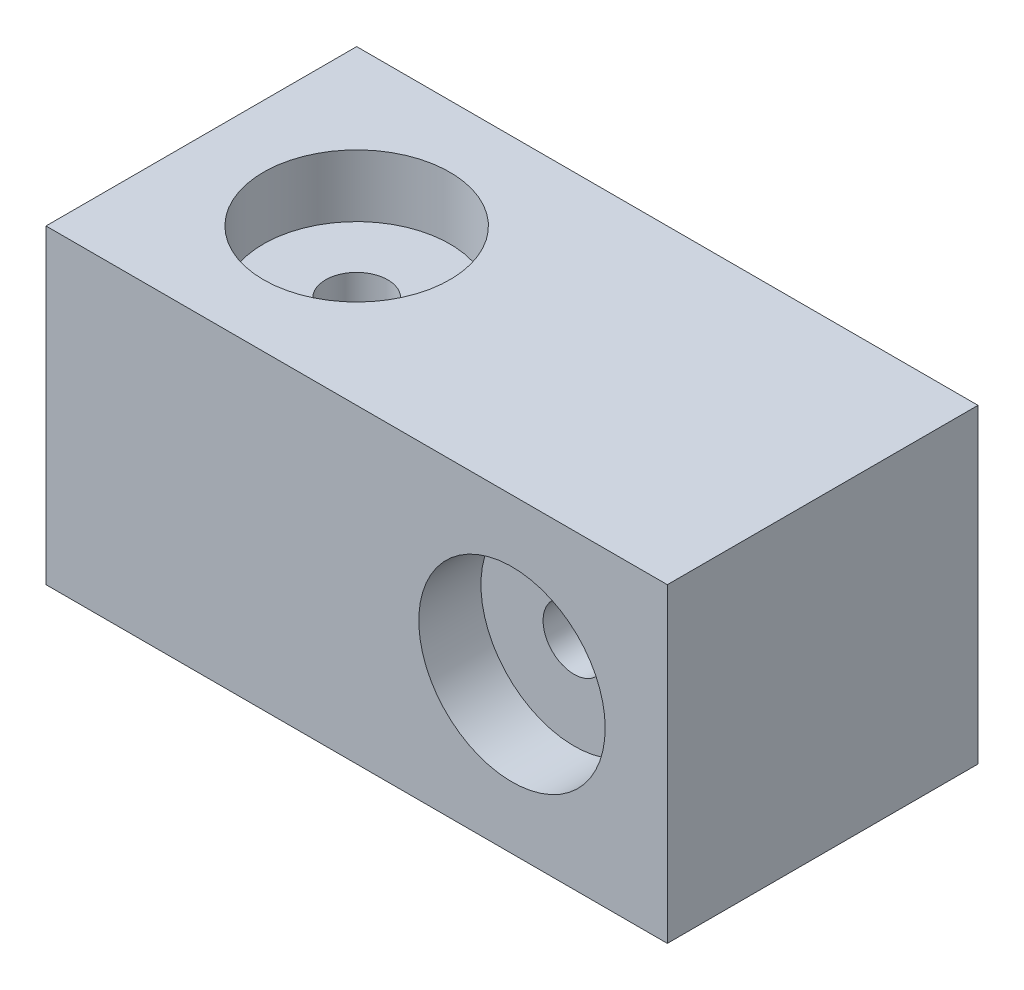
ISO-10303-21;
HEADER;
FILE_DESCRIPTION(('STEP AP214'),'2;1');
FILE_NAME('part.step','',(''),(''),'','','');
FILE_SCHEMA(('AUTOMOTIVE_DESIGN { 1 0 10303 214 1 1 1 1 }'));
ENDSEC;
DATA;
#1=APPLICATION_CONTEXT('core data for automotive mechanical design processes');
#2=APPLICATION_PROTOCOL_DEFINITION('international standard','automotive_design',2000,#1);
#3=PRODUCT_CONTEXT('',#1,'mechanical');
#4=PRODUCT('Part','Part','',(#3));
#5=PRODUCT_RELATED_PRODUCT_CATEGORY('part','',(#4));
#6=PRODUCT_DEFINITION_FORMATION('','',#4);
#7=PRODUCT_DEFINITION_CONTEXT('part definition',#1,'design');
#8=PRODUCT_DEFINITION('design','',#6,#7);
#9=PRODUCT_DEFINITION_SHAPE('','',#8);
#10=(LENGTH_UNIT() NAMED_UNIT(*) SI_UNIT(.MILLI.,.METRE.));
#11=(NAMED_UNIT(*) PLANE_ANGLE_UNIT() SI_UNIT($,.RADIAN.));
#12=(NAMED_UNIT(*) SI_UNIT($,.STERADIAN.) SOLID_ANGLE_UNIT());
#13=UNCERTAINTY_MEASURE_WITH_UNIT(LENGTH_MEASURE(1.E-05),#10,'distance_accuracy_value','');
#14=(GEOMETRIC_REPRESENTATION_CONTEXT(3) GLOBAL_UNCERTAINTY_ASSIGNED_CONTEXT((#13)) GLOBAL_UNIT_ASSIGNED_CONTEXT((#10,
#11,#12)) REPRESENTATION_CONTEXT('',''));
#15=CARTESIAN_POINT('',(0.,0.,0.));
#16=DIRECTION('',(0.,0.,1.));
#17=DIRECTION('',(1.,0.,0.));
#18=AXIS2_PLACEMENT_3D('',#15,#16,#17);
#19=CARTESIAN_POINT('',(-24.957264957265,10.,20.));
#20=DIRECTION('',(1.,0.,0.));
#21=DIRECTION('',(0.,0.,-1.));
#22=AXIS2_PLACEMENT_3D('',#19,#20,#21);
#23=PLANE('',#22);
#24=DIRECTION('',(0.,-1.,0.));
#25=VECTOR('',#24,1.);
#26=CARTESIAN_POINT('',(-24.957264957265,10.,0.));
#27=LINE('',#26,#25);
#28=CARTESIAN_POINT('',(-24.957264957265,10.,0.));
#29=VERTEX_POINT('',#28);
#30=CARTESIAN_POINT('',(-24.957264957265,-9.99999999999999,0.));
#31=VERTEX_POINT('',#30);
#32=EDGE_CURVE('E102',#29,#31,#27,.T.);
#33=ORIENTED_EDGE('',*,*,#32,.T.);
#34=DIRECTION('',(0.,0.,-1.));
#35=VECTOR('',#34,1.);
#36=CARTESIAN_POINT('',(-24.957264957265,-9.99999999999999,20.));
#37=LINE('',#36,#35);
#38=CARTESIAN_POINT('',(-24.957264957265,-9.99999999999999,20.));
#39=VERTEX_POINT('',#38);
#40=EDGE_CURVE('E11',#39,#31,#37,.T.);
#41=ORIENTED_EDGE('',*,*,#40,.F.);
#42=DIRECTION('',(0.,-1.,0.));
#43=VECTOR('',#42,1.);
#44=CARTESIAN_POINT('',(-24.957264957265,10.,20.));
#45=LINE('',#44,#43);
#46=CARTESIAN_POINT('',(-24.957264957265,10.,20.));
#47=VERTEX_POINT('',#46);
#48=EDGE_CURVE('E89',#47,#39,#45,.T.);
#49=ORIENTED_EDGE('',*,*,#48,.F.);
#50=DIRECTION('',(0.,0.,-1.));
#51=VECTOR('',#50,1.);
#52=CARTESIAN_POINT('',(-24.957264957265,10.,20.));
#53=LINE('',#52,#51);
#54=EDGE_CURVE('E98',#47,#29,#53,.T.);
#55=ORIENTED_EDGE('',*,*,#54,.T.);
#56=EDGE_LOOP('',(#33,#41,#49,#55));
#57=FACE_BOUND('',#56,.T.);
#58=ADVANCED_FACE('F36',(#57),#23,.F.);
#59=CARTESIAN_POINT('',(-24.957264957265,-9.99999999999999,20.));
#60=DIRECTION('',(0.,1.,0.));
#61=DIRECTION('',(-1.,0.,0.));
#62=AXIS2_PLACEMENT_3D('',#59,#60,#61);
#63=PLANE('',#62);
#64=CARTESIAN_POINT('',(-14.957264957265,-9.99999999999999,10.));
#65=DIRECTION('',(0.,1.,0.));
#66=DIRECTION('',(0.,0.,1.));
#67=AXIS2_PLACEMENT_3D('',#64,#65,#66);
#68=CIRCLE('',#67,2.);
#69=CARTESIAN_POINT('',(-14.957264957265,-9.99999999999999,12.));
#70=VERTEX_POINT('',#69);
#71=EDGE_CURVE('E164',#70,#70,#68,.T.);
#72=ORIENTED_EDGE('',*,*,#71,.T.);
#73=EDGE_LOOP('',(#72));
#74=FACE_BOUND('',#73,.T.);
#75=DIRECTION('',(1.,0.,0.));
#76=VECTOR('',#75,1.);
#77=CARTESIAN_POINT('',(-24.957264957265,-9.99999999999999,0.));
#78=LINE('',#77,#76);
#79=CARTESIAN_POINT('',(15.042735042735,-9.99999999999999,0.));
#80=VERTEX_POINT('',#79);
#81=EDGE_CURVE('E93',#31,#80,#78,.T.);
#82=ORIENTED_EDGE('',*,*,#81,.T.);
#83=DIRECTION('',(0.,0.,-1.));
#84=VECTOR('',#83,1.);
#85=CARTESIAN_POINT('',(15.042735042735,-9.99999999999999,20.));
#86=LINE('',#85,#84);
#87=CARTESIAN_POINT('',(15.042735042735,-9.99999999999999,20.));
#88=VERTEX_POINT('',#87);
#89=EDGE_CURVE('E45',#88,#80,#86,.T.);
#90=ORIENTED_EDGE('',*,*,#89,.F.);
#91=DIRECTION('',(1.,0.,0.));
#92=VECTOR('',#91,1.);
#93=CARTESIAN_POINT('',(-24.957264957265,-9.99999999999999,20.));
#94=LINE('',#93,#92);
#95=EDGE_CURVE('E84',#39,#88,#94,.T.);
#96=ORIENTED_EDGE('',*,*,#95,.F.);
#97=ORIENTED_EDGE('',*,*,#40,.T.);
#98=EDGE_LOOP('',(#82,#90,#96,#97));
#99=FACE_BOUND('',#98,.T.);
#100=ADVANCED_FACE('F92',(#74,#99),#63,.F.);
#101=CARTESIAN_POINT('',(15.042735042735,10.,20.));
#102=DIRECTION('',(-1.,0.,0.));
#103=DIRECTION('',(0.,0.,1.));
#104=AXIS2_PLACEMENT_3D('',#101,#102,#103);
#105=PLANE('',#104);
#106=DIRECTION('',(0.,1.,0.));
#107=VECTOR('',#106,1.);
#108=CARTESIAN_POINT('',(15.042735042735,10.,0.));
#109=LINE('',#108,#107);
#110=CARTESIAN_POINT('',(15.042735042735,10.,0.));
#111=VERTEX_POINT('',#110);
#112=EDGE_CURVE('E71',#80,#111,#109,.T.);
#113=ORIENTED_EDGE('',*,*,#112,.T.);
#114=DIRECTION('',(0.,0.,-1.));
#115=VECTOR('',#114,1.);
#116=CARTESIAN_POINT('',(15.042735042735,10.,20.));
#117=LINE('',#116,#115);
#118=CARTESIAN_POINT('',(15.042735042735,10.,20.));
#119=VERTEX_POINT('',#118);
#120=EDGE_CURVE('E94',#119,#111,#117,.T.);
#121=ORIENTED_EDGE('',*,*,#120,.F.);
#122=DIRECTION('',(0.,1.,0.));
#123=VECTOR('',#122,1.);
#124=CARTESIAN_POINT('',(15.042735042735,10.,20.));
#125=LINE('',#124,#123);
#126=EDGE_CURVE('E87',#88,#119,#125,.T.);
#127=ORIENTED_EDGE('',*,*,#126,.F.);
#128=ORIENTED_EDGE('',*,*,#89,.T.);
#129=EDGE_LOOP('',(#113,#121,#127,#128));
#130=FACE_BOUND('',#129,.T.);
#131=ADVANCED_FACE('F96',(#130),#105,.F.);
#132=CARTESIAN_POINT('',(-24.957264957265,10.,20.));
#133=DIRECTION('',(0.,-1.,0.));
#134=DIRECTION('',(0.,0.,-1.));
#135=AXIS2_PLACEMENT_3D('',#132,#133,#134);
#136=PLANE('',#135);
#137=CARTESIAN_POINT('',(-14.957264957265,10.,10.));
#138=DIRECTION('',(0.,1.,0.));
#139=DIRECTION('',(0.,0.,1.));
#140=AXIS2_PLACEMENT_3D('',#137,#138,#139);
#141=CIRCLE('',#140,6.);
#142=CARTESIAN_POINT('',(-14.957264957265,10.,16.));
#143=VERTEX_POINT('',#142);
#144=EDGE_CURVE('E124',#143,#143,#141,.T.);
#145=ORIENTED_EDGE('',*,*,#144,.F.);
#146=EDGE_LOOP('',(#145));
#147=FACE_BOUND('',#146,.T.);
#148=DIRECTION('',(-1.,0.,0.));
#149=VECTOR('',#148,1.);
#150=CARTESIAN_POINT('',(-24.957264957265,10.,0.));
#151=LINE('',#150,#149);
#152=EDGE_CURVE('E77',#111,#29,#151,.T.);
#153=ORIENTED_EDGE('',*,*,#152,.T.);
#154=ORIENTED_EDGE('',*,*,#54,.F.);
#155=DIRECTION('',(-1.,0.,0.));
#156=VECTOR('',#155,1.);
#157=CARTESIAN_POINT('',(-24.957264957265,10.,20.));
#158=LINE('',#157,#156);
#159=EDGE_CURVE('E54',#119,#47,#158,.T.);
#160=ORIENTED_EDGE('',*,*,#159,.F.);
#161=ORIENTED_EDGE('',*,*,#120,.T.);
#162=EDGE_LOOP('',(#153,#154,#160,#161));
#163=FACE_BOUND('',#162,.T.);
#164=ADVANCED_FACE('F141',(#147,#163),#136,.F.);
#165=CARTESIAN_POINT('',(0.,0.,20.));
#166=DIRECTION('',(0.,0.,1.));
#167=DIRECTION('',(1.,0.,0.));
#168=AXIS2_PLACEMENT_3D('',#165,#166,#167);
#169=PLANE('',#168);
#170=CARTESIAN_POINT('',(5.04273504273503,0.,20.));
#171=DIRECTION('',(0.,0.,1.));
#172=DIRECTION('',(1.,0.,0.));
#173=AXIS2_PLACEMENT_3D('',#170,#171,#172);
#174=CIRCLE('',#173,6.);
#175=CARTESIAN_POINT('',(11.042735042735,0.,20.));
#176=VERTEX_POINT('',#175);
#177=EDGE_CURVE('E112',#176,#176,#174,.T.);
#178=ORIENTED_EDGE('',*,*,#177,.F.);
#179=EDGE_LOOP('',(#178));
#180=FACE_BOUND('',#179,.T.);
#181=ORIENTED_EDGE('',*,*,#48,.T.);
#182=ORIENTED_EDGE('',*,*,#95,.T.);
#183=ORIENTED_EDGE('',*,*,#126,.T.);
#184=ORIENTED_EDGE('',*,*,#159,.T.);
#185=EDGE_LOOP('',(#181,#182,#183,#184));
#186=FACE_BOUND('',#185,.T.);
#187=ADVANCED_FACE('F85',(#180,#186),#169,.T.);
#188=CARTESIAN_POINT('',(0.,0.,0.));
#189=DIRECTION('',(0.,0.,1.));
#190=DIRECTION('',(1.,0.,0.));
#191=AXIS2_PLACEMENT_3D('',#188,#189,#190);
#192=PLANE('',#191);
#193=CARTESIAN_POINT('',(5.04273504273503,0.,0.));
#194=DIRECTION('',(0.,0.,1.));
#195=DIRECTION('',(1.,0.,0.));
#196=AXIS2_PLACEMENT_3D('',#193,#194,#195);
#197=CIRCLE('',#196,2.);
#198=CARTESIAN_POINT('',(7.04273504273503,0.,0.));
#199=VERTEX_POINT('',#198);
#200=EDGE_CURVE('E113',#199,#199,#197,.T.);
#201=ORIENTED_EDGE('',*,*,#200,.T.);
#202=EDGE_LOOP('',(#201));
#203=FACE_BOUND('',#202,.T.);
#204=ORIENTED_EDGE('',*,*,#32,.F.);
#205=ORIENTED_EDGE('',*,*,#152,.F.);
#206=ORIENTED_EDGE('',*,*,#112,.F.);
#207=ORIENTED_EDGE('',*,*,#81,.F.);
#208=EDGE_LOOP('',(#204,#205,#206,#207));
#209=FACE_BOUND('',#208,.T.);
#210=ADVANCED_FACE('F136',(#203,#209),#192,.F.);
#211=CARTESIAN_POINT('',(5.04273504273503,0.,16.));
#212=DIRECTION('',(0.,0.,1.));
#213=DIRECTION('',(1.,0.,0.));
#214=AXIS2_PLACEMENT_3D('',#211,#212,#213);
#215=CYLINDRICAL_SURFACE('',#214,6.);
#216=CARTESIAN_POINT('',(5.04273504273503,0.,16.));
#217=DIRECTION('',(0.,0.,1.));
#218=DIRECTION('',(1.,0.,0.));
#219=AXIS2_PLACEMENT_3D('',#216,#217,#218);
#220=CIRCLE('',#219,6.);
#221=CARTESIAN_POINT('',(11.042735042735,0.,16.));
#222=VERTEX_POINT('',#221);
#223=EDGE_CURVE('E105',#222,#222,#220,.T.);
#224=ORIENTED_EDGE('',*,*,#223,.F.);
#225=EDGE_LOOP('',(#224));
#226=FACE_BOUND('',#225,.T.);
#227=ORIENTED_EDGE('',*,*,#177,.T.);
#228=EDGE_LOOP('',(#227));
#229=FACE_BOUND('',#228,.T.);
#230=ADVANCED_FACE('F133',(#226,#229),#215,.F.);
#231=CARTESIAN_POINT('',(0.,0.,16.));
#232=DIRECTION('',(0.,0.,1.));
#233=DIRECTION('',(1.,0.,0.));
#234=AXIS2_PLACEMENT_3D('',#231,#232,#233);
#235=PLANE('',#234);
#236=CARTESIAN_POINT('',(5.04273504273503,0.,16.));
#237=DIRECTION('',(0.,0.,1.));
#238=DIRECTION('',(1.,0.,0.));
#239=AXIS2_PLACEMENT_3D('',#236,#237,#238);
#240=CIRCLE('',#239,2.);
#241=CARTESIAN_POINT('',(7.04273504273503,0.,16.));
#242=VERTEX_POINT('',#241);
#243=EDGE_CURVE('E110',#242,#242,#240,.T.);
#244=ORIENTED_EDGE('',*,*,#243,.F.);
#245=EDGE_LOOP('',(#244));
#246=FACE_BOUND('',#245,.T.);
#247=ORIENTED_EDGE('',*,*,#223,.T.);
#248=EDGE_LOOP('',(#247));
#249=FACE_BOUND('',#248,.T.);
#250=ADVANCED_FACE('F131',(#246,#249),#235,.T.);
#251=CARTESIAN_POINT('',(5.04273504273503,0.,0.));
#252=DIRECTION('',(0.,0.,1.));
#253=DIRECTION('',(1.,0.,0.));
#254=AXIS2_PLACEMENT_3D('',#251,#252,#253);
#255=CYLINDRICAL_SURFACE('',#254,2.);
#256=ORIENTED_EDGE('',*,*,#243,.T.);
#257=EDGE_LOOP('',(#256));
#258=FACE_BOUND('',#257,.T.);
#259=ORIENTED_EDGE('',*,*,#200,.F.);
#260=EDGE_LOOP('',(#259));
#261=FACE_BOUND('',#260,.T.);
#262=ADVANCED_FACE('F176',(#258,#261),#255,.F.);
#263=CARTESIAN_POINT('',(-14.957264957265,6.00000000000001,10.));
#264=DIRECTION('',(0.,1.,0.));
#265=DIRECTION('',(0.,0.,1.));
#266=AXIS2_PLACEMENT_3D('',#263,#264,#265);
#267=CYLINDRICAL_SURFACE('',#266,6.);
#268=CARTESIAN_POINT('',(-14.957264957265,6.00000000000001,10.));
#269=DIRECTION('',(0.,1.,0.));
#270=DIRECTION('',(0.,0.,1.));
#271=AXIS2_PLACEMENT_3D('',#268,#269,#270);
#272=CIRCLE('',#271,6.);
#273=CARTESIAN_POINT('',(-14.957264957265,6.00000000000001,16.));
#274=VERTEX_POINT('',#273);
#275=EDGE_CURVE('E119',#274,#274,#272,.T.);
#276=ORIENTED_EDGE('',*,*,#275,.F.);
#277=EDGE_LOOP('',(#276));
#278=FACE_BOUND('',#277,.T.);
#279=ORIENTED_EDGE('',*,*,#144,.T.);
#280=EDGE_LOOP('',(#279));
#281=FACE_BOUND('',#280,.T.);
#282=ADVANCED_FACE('F173',(#278,#281),#267,.F.);
#283=CARTESIAN_POINT('',(0.,6.00000000000001,0.));
#284=DIRECTION('',(0.,1.,0.));
#285=DIRECTION('',(0.,0.,1.));
#286=AXIS2_PLACEMENT_3D('',#283,#284,#285);
#287=PLANE('',#286);
#288=CARTESIAN_POINT('',(-14.957264957265,6.00000000000001,10.));
#289=DIRECTION('',(0.,1.,0.));
#290=DIRECTION('',(0.,0.,1.));
#291=AXIS2_PLACEMENT_3D('',#288,#289,#290);
#292=CIRCLE('',#291,2.);
#293=CARTESIAN_POINT('',(-14.957264957265,6.00000000000001,12.));
#294=VERTEX_POINT('',#293);
#295=EDGE_CURVE('E39',#294,#294,#292,.T.);
#296=ORIENTED_EDGE('',*,*,#295,.F.);
#297=EDGE_LOOP('',(#296));
#298=FACE_BOUND('',#297,.T.);
#299=ORIENTED_EDGE('',*,*,#275,.T.);
#300=EDGE_LOOP('',(#299));
#301=FACE_BOUND('',#300,.T.);
#302=ADVANCED_FACE('F175',(#298,#301),#287,.T.);
#303=CARTESIAN_POINT('',(-14.957264957265,-9.99999999999999,10.));
#304=DIRECTION('',(0.,1.,0.));
#305=DIRECTION('',(0.,0.,1.));
#306=AXIS2_PLACEMENT_3D('',#303,#304,#305);
#307=CYLINDRICAL_SURFACE('',#306,2.);
#308=ORIENTED_EDGE('',*,*,#295,.T.);
#309=EDGE_LOOP('',(#308));
#310=FACE_BOUND('',#309,.T.);
#311=ORIENTED_EDGE('',*,*,#71,.F.);
#312=EDGE_LOOP('',(#311));
#313=FACE_BOUND('',#312,.T.);
#314=ADVANCED_FACE('F183',(#310,#313),#307,.F.);
#315=CLOSED_SHELL('',(#58,#100,#131,#164,#187,#210,#230,#250,#262,#282,#302,#314));
#316=MANIFOLD_SOLID_BREP('B2',#315);
#317=ADVANCED_BREP_SHAPE_REPRESENTATION('',(#18,#316),#14);
#318=SHAPE_DEFINITION_REPRESENTATION(#9,#317);
ENDSEC;
END-ISO-10303-21;
